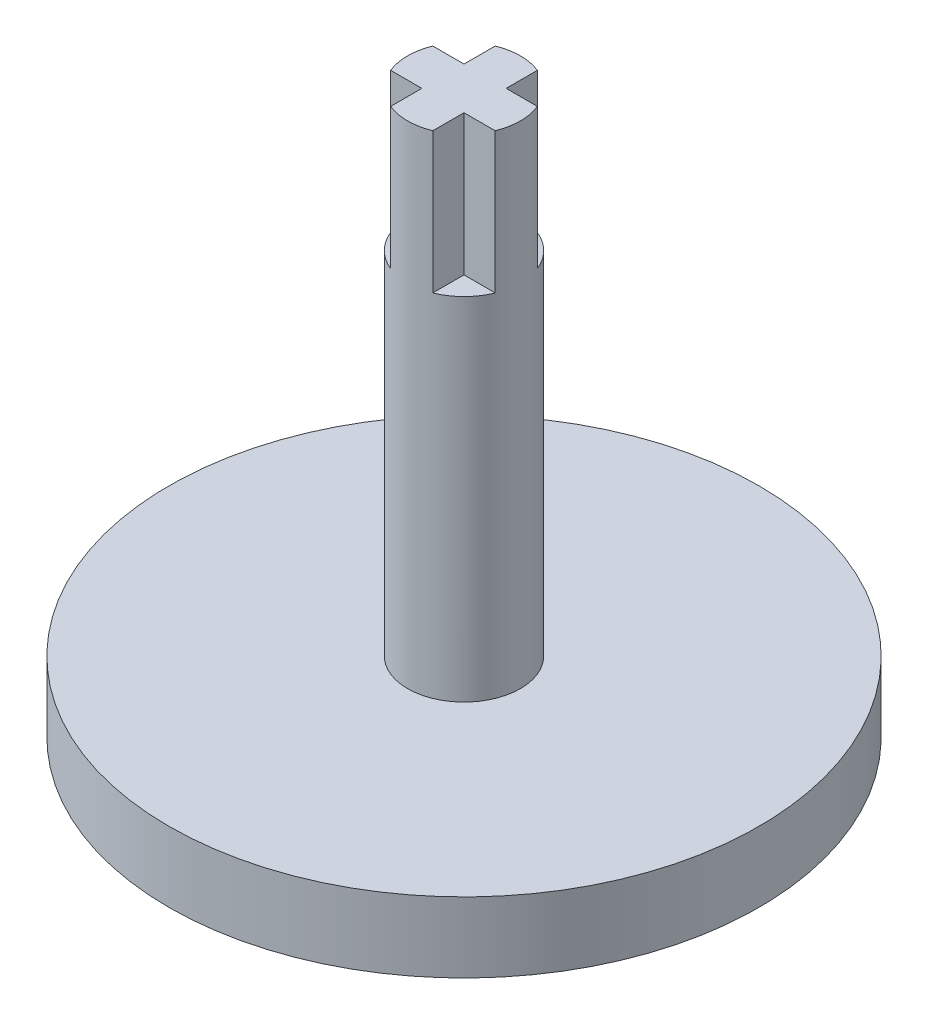
ISO-10303-21;
HEADER;
FILE_DESCRIPTION(('STEP AP214'),'2;1');
FILE_NAME('part.step','',(''),(''),'','','');
FILE_SCHEMA(('AUTOMOTIVE_DESIGN { 1 0 10303 214 1 1 1 1 }'));
ENDSEC;
DATA;
#1=APPLICATION_CONTEXT('core data for automotive mechanical design processes');
#2=APPLICATION_PROTOCOL_DEFINITION('international standard','automotive_design',2000,#1);
#3=PRODUCT_CONTEXT('',#1,'mechanical');
#4=PRODUCT('Part','Part','',(#3));
#5=PRODUCT_RELATED_PRODUCT_CATEGORY('part','',(#4));
#6=PRODUCT_DEFINITION_FORMATION('','',#4);
#7=PRODUCT_DEFINITION_CONTEXT('part definition',#1,'design');
#8=PRODUCT_DEFINITION('design','',#6,#7);
#9=PRODUCT_DEFINITION_SHAPE('','',#8);
#10=(LENGTH_UNIT() NAMED_UNIT(*) SI_UNIT(.MILLI.,.METRE.));
#11=(NAMED_UNIT(*) PLANE_ANGLE_UNIT() SI_UNIT($,.RADIAN.));
#12=(NAMED_UNIT(*) SI_UNIT($,.STERADIAN.) SOLID_ANGLE_UNIT());
#13=UNCERTAINTY_MEASURE_WITH_UNIT(LENGTH_MEASURE(1.E-05),#10,'distance_accuracy_value','');
#14=(GEOMETRIC_REPRESENTATION_CONTEXT(3) GLOBAL_UNCERTAINTY_ASSIGNED_CONTEXT((#13)) GLOBAL_UNIT_ASSIGNED_CONTEXT((#10,
#11,#12)) REPRESENTATION_CONTEXT('',''));
#15=CARTESIAN_POINT('',(0.,0.,0.));
#16=DIRECTION('',(0.,0.,1.));
#17=DIRECTION('',(1.,0.,0.));
#18=AXIS2_PLACEMENT_3D('',#15,#16,#17);
#19=CARTESIAN_POINT('',(0.,30.,0.));
#20=DIRECTION('',(0.,1.,0.));
#21=DIRECTION('',(0.,0.,1.));
#22=AXIS2_PLACEMENT_3D('',#19,#20,#21);
#23=PLANE('',#22);
#24=DIRECTION('',(0.,0.,-1.));
#25=VECTOR('',#24,1.);
#26=CARTESIAN_POINT('',(1.5,30.,0.));
#27=LINE('',#26,#25);
#28=CARTESIAN_POINT('',(1.50000000000002,30.,-1.5));
#29=VERTEX_POINT('',#28);
#30=CARTESIAN_POINT('',(1.50000000000003,30.,-3.72427509725046));
#31=VERTEX_POINT('',#30);
#32=EDGE_CURVE('E57',#29,#31,#27,.T.);
#33=ORIENTED_EDGE('',*,*,#32,.F.);
#34=DIRECTION('',(-1.,0.,0.));
#35=VECTOR('',#34,1.);
#36=CARTESIAN_POINT('',(0.,30.,-1.5));
#37=LINE('',#36,#35);
#38=CARTESIAN_POINT('',(3.72427509725048,30.,-1.49999999999999));
#39=VERTEX_POINT('',#38);
#40=EDGE_CURVE('E315',#39,#29,#37,.T.);
#41=ORIENTED_EDGE('',*,*,#40,.F.);
#42=CARTESIAN_POINT('',(0.,30.,0.));
#43=DIRECTION('',(0.,1.,0.));
#44=DIRECTION('',(0.,0.,1.));
#45=AXIS2_PLACEMENT_3D('',#42,#43,#44);
#46=CIRCLE('',#45,4.015);
#47=EDGE_CURVE('E211',#39,#31,#46,.T.);
#48=ORIENTED_EDGE('',*,*,#47,.T.);
#49=EDGE_LOOP('',(#33,#41,#48));
#50=FACE_BOUND('',#49,.T.);
#51=ADVANCED_FACE('F40',(#50),#23,.T.);
#52=DIRECTION('',(1.,0.,0.));
#53=VECTOR('',#52,1.);
#54=CARTESIAN_POINT('',(0.,30.,1.5));
#55=LINE('',#54,#53);
#56=CARTESIAN_POINT('',(1.49999999999999,30.,1.50000000000003));
#57=VERTEX_POINT('',#56);
#58=CARTESIAN_POINT('',(3.72427509725045,30.,1.50000000000004));
#59=VERTEX_POINT('',#58);
#60=EDGE_CURVE('E65',#57,#59,#55,.T.);
#61=ORIENTED_EDGE('',*,*,#60,.F.);
#62=DIRECTION('',(0.,0.,-1.));
#63=VECTOR('',#62,1.);
#64=CARTESIAN_POINT('',(1.5,30.,0.));
#65=LINE('',#64,#63);
#66=CARTESIAN_POINT('',(1.49999999999997,30.,3.72427509725048));
#67=VERTEX_POINT('',#66);
#68=EDGE_CURVE('E276',#67,#57,#65,.T.);
#69=ORIENTED_EDGE('',*,*,#68,.F.);
#70=EDGE_CURVE('E209',#67,#59,#46,.T.);
#71=ORIENTED_EDGE('',*,*,#70,.T.);
#72=EDGE_LOOP('',(#61,#69,#71));
#73=FACE_BOUND('',#72,.T.);
#74=ADVANCED_FACE('F241',(#73),#23,.T.);
#75=DIRECTION('',(0.,0.,1.));
#76=VECTOR('',#75,1.);
#77=CARTESIAN_POINT('',(-1.5,30.,0.));
#78=LINE('',#77,#76);
#79=CARTESIAN_POINT('',(-1.5,30.,1.49999999999997));
#80=VERTEX_POINT('',#79);
#81=CARTESIAN_POINT('',(-1.5,30.,3.72427509725047));
#82=VERTEX_POINT('',#81);
#83=EDGE_CURVE('E268',#80,#82,#78,.T.);
#84=ORIENTED_EDGE('',*,*,#83,.F.);
#85=DIRECTION('',(1.,0.,0.));
#86=VECTOR('',#85,1.);
#87=CARTESIAN_POINT('',(0.,30.,1.5));
#88=LINE('',#87,#86);
#89=CARTESIAN_POINT('',(-3.72427509725049,30.,1.49999999999996));
#90=VERTEX_POINT('',#89);
#91=EDGE_CURVE('E270',#90,#80,#88,.T.);
#92=ORIENTED_EDGE('',*,*,#91,.F.);
#93=EDGE_CURVE('E206',#90,#82,#46,.T.);
#94=ORIENTED_EDGE('',*,*,#93,.T.);
#95=EDGE_LOOP('',(#84,#92,#94));
#96=FACE_BOUND('',#95,.T.);
#97=ADVANCED_FACE('F247',(#96),#23,.T.);
#98=CARTESIAN_POINT('',(0.,5.,0.));
#99=DIRECTION('',(0.,-1.,0.));
#100=DIRECTION('',(0.,0.,-1.));
#101=AXIS2_PLACEMENT_3D('',#98,#99,#100);
#102=CYLINDRICAL_SURFACE('',#101,21.);
#103=CARTESIAN_POINT('',(0.,5.,0.));
#104=DIRECTION('',(0.,1.,0.));
#105=DIRECTION('',(0.,0.,1.));
#106=AXIS2_PLACEMENT_3D('',#103,#104,#105);
#107=CIRCLE('',#106,21.);
#108=CARTESIAN_POINT('',(0.,5.,21.));
#109=VERTEX_POINT('',#108);
#110=EDGE_CURVE('E49',#109,#109,#107,.T.);
#111=ORIENTED_EDGE('',*,*,#110,.F.);
#112=EDGE_LOOP('',(#111));
#113=FACE_BOUND('',#112,.T.);
#114=CARTESIAN_POINT('',(0.,0.,0.));
#115=DIRECTION('',(0.,1.,0.));
#116=DIRECTION('',(0.,0.,1.));
#117=AXIS2_PLACEMENT_3D('',#114,#115,#116);
#118=CIRCLE('',#117,21.);
#119=CARTESIAN_POINT('',(0.,0.,21.));
#120=VERTEX_POINT('',#119);
#121=EDGE_CURVE('E44',#120,#120,#118,.T.);
#122=ORIENTED_EDGE('',*,*,#121,.T.);
#123=EDGE_LOOP('',(#122));
#124=FACE_BOUND('',#123,.T.);
#125=ADVANCED_FACE('F42',(#113,#124),#102,.T.);
#126=CARTESIAN_POINT('',(0.,5.,0.));
#127=DIRECTION('',(0.,1.,0.));
#128=DIRECTION('',(0.,0.,1.));
#129=AXIS2_PLACEMENT_3D('',#126,#127,#128);
#130=PLANE('',#129);
#131=CARTESIAN_POINT('',(0.,5.,0.));
#132=DIRECTION('',(0.,1.,0.));
#133=DIRECTION('',(0.,0.,1.));
#134=AXIS2_PLACEMENT_3D('',#131,#132,#133);
#135=CIRCLE('',#134,4.015);
#136=CARTESIAN_POINT('',(0.,5.,4.015));
#137=VERTEX_POINT('',#136);
#138=EDGE_CURVE('E11',#137,#137,#135,.T.);
#139=ORIENTED_EDGE('',*,*,#138,.F.);
#140=EDGE_LOOP('',(#139));
#141=FACE_BOUND('',#140,.T.);
#142=ORIENTED_EDGE('',*,*,#110,.T.);
#143=EDGE_LOOP('',(#142));
#144=FACE_BOUND('',#143,.T.);
#145=ADVANCED_FACE('F227',(#141,#144),#130,.T.);
#146=CARTESIAN_POINT('',(0.,0.,0.));
#147=DIRECTION('',(0.,1.,0.));
#148=DIRECTION('',(0.,0.,1.));
#149=AXIS2_PLACEMENT_3D('',#146,#147,#148);
#150=PLANE('',#149);
#151=CARTESIAN_POINT('',(0.,0.,14.5));
#152=DIRECTION('',(0.,-1.,0.));
#153=DIRECTION('',(0.,0.,1.));
#154=AXIS2_PLACEMENT_3D('',#151,#152,#153);
#155=CIRCLE('',#154,5.15);
#156=CARTESIAN_POINT('',(0.,0.,19.65));
#157=VERTEX_POINT('',#156);
#158=EDGE_CURVE('E176',#157,#157,#155,.T.);
#159=ORIENTED_EDGE('',*,*,#158,.F.);
#160=EDGE_LOOP('',(#159));
#161=FACE_BOUND('',#160,.T.);
#162=CARTESIAN_POINT('',(-10.253048327205,0.,10.2530483272049));
#163=DIRECTION('',(0.,-1.,0.));
#164=DIRECTION('',(-0.707106781186554,0.,0.707106781186541));
#165=AXIS2_PLACEMENT_3D('',#162,#163,#164);
#166=CIRCLE('',#165,5.15);
#167=CARTESIAN_POINT('',(-13.8946482503158,0.,13.8946482503155));
#168=VERTEX_POINT('',#167);
#169=EDGE_CURVE('E170',#168,#168,#166,.T.);
#170=ORIENTED_EDGE('',*,*,#169,.F.);
#171=EDGE_LOOP('',(#170));
#172=FACE_BOUND('',#171,.T.);
#173=CARTESIAN_POINT('',(14.5,0.,0.));
#174=DIRECTION('',(0.,-1.,0.));
#175=DIRECTION('',(1.,0.,0.));
#176=AXIS2_PLACEMENT_3D('',#173,#174,#175);
#177=CIRCLE('',#176,5.15);
#178=CARTESIAN_POINT('',(19.65,0.,0.));
#179=VERTEX_POINT('',#178);
#180=EDGE_CURVE('E188',#179,#179,#177,.T.);
#181=ORIENTED_EDGE('',*,*,#180,.F.);
#182=EDGE_LOOP('',(#181));
#183=FACE_BOUND('',#182,.T.);
#184=CARTESIAN_POINT('',(10.2530483272049,0.,10.253048327205));
#185=DIRECTION('',(0.,-1.,0.));
#186=DIRECTION('',(0.707106781186544,0.,0.707106781186551));
#187=AXIS2_PLACEMENT_3D('',#184,#185,#186);
#188=CIRCLE('',#187,5.15);
#189=CARTESIAN_POINT('',(13.8946482503156,0.,13.8946482503157));
#190=VERTEX_POINT('',#189);
#191=EDGE_CURVE('E182',#190,#190,#188,.T.);
#192=ORIENTED_EDGE('',*,*,#191,.F.);
#193=EDGE_LOOP('',(#192));
#194=FACE_BOUND('',#193,.T.);
#195=CARTESIAN_POINT('',(-10.2530483272048,0.,-10.2530483272051));
#196=DIRECTION('',(0.,-1.,0.));
#197=DIRECTION('',(-0.707106781186539,0.,-0.707106781186556));
#198=AXIS2_PLACEMENT_3D('',#195,#196,#197);
#199=CIRCLE('',#198,5.15);
#200=CARTESIAN_POINT('',(-13.8946482503155,0.,-13.8946482503158));
#201=VERTEX_POINT('',#200);
#202=EDGE_CURVE('E155',#201,#201,#199,.T.);
#203=ORIENTED_EDGE('',*,*,#202,.F.);
#204=EDGE_LOOP('',(#203));
#205=FACE_BOUND('',#204,.T.);
#206=CARTESIAN_POINT('',(-14.5,0.,-1.51879438239676E-13));
#207=DIRECTION('',(0.,-1.,0.));
#208=DIRECTION('',(-1.,0.,0.));
#209=AXIS2_PLACEMENT_3D('',#206,#207,#208);
#210=CIRCLE('',#209,5.15);
#211=CARTESIAN_POINT('',(-19.65,0.,-2.05822824924803E-13));
#212=VERTEX_POINT('',#211);
#213=EDGE_CURVE('E165',#212,#212,#210,.T.);
#214=ORIENTED_EDGE('',*,*,#213,.F.);
#215=EDGE_LOOP('',(#214));
#216=FACE_BOUND('',#215,.T.);
#217=CARTESIAN_POINT('',(10.253048327205,0.,-10.2530483272049));
#218=DIRECTION('',(0.,-1.,0.));
#219=DIRECTION('',(0.707106781186549,0.,-0.707106781186546));
#220=AXIS2_PLACEMENT_3D('',#217,#218,#219);
#221=CIRCLE('',#220,5.15);
#222=CARTESIAN_POINT('',(13.8946482503157,0.,-13.8946482503156));
#223=VERTEX_POINT('',#222);
#224=EDGE_CURVE('E194',#223,#223,#221,.T.);
#225=ORIENTED_EDGE('',*,*,#224,.F.);
#226=EDGE_LOOP('',(#225));
#227=FACE_BOUND('',#226,.T.);
#228=CARTESIAN_POINT('',(0.,0.,-14.5));
#229=DIRECTION('',(0.,-1.,0.));
#230=DIRECTION('',(0.,0.,-1.));
#231=AXIS2_PLACEMENT_3D('',#228,#229,#230);
#232=CIRCLE('',#231,5.15);
#233=CARTESIAN_POINT('',(0.,0.,-19.65));
#234=VERTEX_POINT('',#233);
#235=EDGE_CURVE('E200',#234,#234,#232,.T.);
#236=ORIENTED_EDGE('',*,*,#235,.F.);
#237=EDGE_LOOP('',(#236));
#238=FACE_BOUND('',#237,.T.);
#239=CARTESIAN_POINT('',(0.,0.,0.));
#240=DIRECTION('',(0.,-1.,0.));
#241=DIRECTION('',(0.,0.,-1.));
#242=AXIS2_PLACEMENT_3D('',#239,#240,#241);
#243=CIRCLE('',#242,6.05);
#244=CARTESIAN_POINT('',(0.,0.,-6.05));
#245=VERTEX_POINT('',#244);
#246=EDGE_CURVE('E210',#245,#245,#243,.T.);
#247=ORIENTED_EDGE('',*,*,#246,.F.);
#248=EDGE_LOOP('',(#247));
#249=FACE_BOUND('',#248,.T.);
#250=ORIENTED_EDGE('',*,*,#121,.F.);
#251=EDGE_LOOP('',(#250));
#252=FACE_BOUND('',#251,.T.);
#253=ADVANCED_FACE('F224',(#161,#172,#183,#194,#205,#216,#227,#238,#249,#252),#150,.F.);
#254=CARTESIAN_POINT('',(0.,3.5,0.));
#255=DIRECTION('',(0.,-1.,0.));
#256=DIRECTION('',(0.,0.,-1.));
#257=AXIS2_PLACEMENT_3D('',#254,#255,#256);
#258=CYLINDRICAL_SURFACE('',#257,6.05);
#259=CARTESIAN_POINT('',(0.,3.5,0.));
#260=DIRECTION('',(0.,-1.,0.));
#261=DIRECTION('',(0.,0.,-1.));
#262=AXIS2_PLACEMENT_3D('',#259,#260,#261);
#263=CIRCLE('',#262,6.05);
#264=CARTESIAN_POINT('',(0.,3.5,-6.05));
#265=VERTEX_POINT('',#264);
#266=EDGE_CURVE('E213',#265,#265,#263,.T.);
#267=ORIENTED_EDGE('',*,*,#266,.F.);
#268=EDGE_LOOP('',(#267));
#269=FACE_BOUND('',#268,.T.);
#270=ORIENTED_EDGE('',*,*,#246,.T.);
#271=EDGE_LOOP('',(#270));
#272=FACE_BOUND('',#271,.T.);
#273=ADVANCED_FACE('F226',(#269,#272),#258,.F.);
#274=CARTESIAN_POINT('',(0.,3.5,0.));
#275=DIRECTION('',(0.,-1.,0.));
#276=DIRECTION('',(0.,0.,-1.));
#277=AXIS2_PLACEMENT_3D('',#274,#275,#276);
#278=PLANE('',#277);
#279=ORIENTED_EDGE('',*,*,#266,.T.);
#280=EDGE_LOOP('',(#279));
#281=FACE_BOUND('',#280,.T.);
#282=ADVANCED_FACE('F233',(#281),#278,.T.);
#283=CARTESIAN_POINT('',(0.,30.,0.));
#284=DIRECTION('',(0.,-1.,0.));
#285=DIRECTION('',(0.,0.,-1.));
#286=AXIS2_PLACEMENT_3D('',#283,#284,#285);
#287=CYLINDRICAL_SURFACE('',#286,4.015);
#288=ORIENTED_EDGE('',*,*,#70,.F.);
#289=DIRECTION('',(0.,-1.,0.));
#290=VECTOR('',#289,1.);
#291=CARTESIAN_POINT('',(1.49999999999997,40.,3.72427509725048));
#292=LINE('',#291,#290);
#293=CARTESIAN_POINT('',(1.49999999999997,40.,3.72427509725048));
#294=VERTEX_POINT('',#293);
#295=EDGE_CURVE('E292',#294,#67,#292,.T.);
#296=ORIENTED_EDGE('',*,*,#295,.F.);
#297=CARTESIAN_POINT('',(0.,40.,0.));
#298=DIRECTION('',(0.,1.,0.));
#299=DIRECTION('',(0.,0.,1.));
#300=AXIS2_PLACEMENT_3D('',#297,#298,#299);
#301=CIRCLE('',#300,4.015);
#302=CARTESIAN_POINT('',(-1.5,40.,3.72427509725047));
#303=VERTEX_POINT('',#302);
#304=EDGE_CURVE('E332',#303,#294,#301,.T.);
#305=ORIENTED_EDGE('',*,*,#304,.F.);
#306=DIRECTION('',(0.,-1.,0.));
#307=VECTOR('',#306,1.);
#308=CARTESIAN_POINT('',(-1.5,40.,3.72427509725047));
#309=LINE('',#308,#307);
#310=EDGE_CURVE('E290',#303,#82,#309,.T.);
#311=ORIENTED_EDGE('',*,*,#310,.T.);
#312=ORIENTED_EDGE('',*,*,#93,.F.);
#313=DIRECTION('',(0.,-1.,0.));
#314=VECTOR('',#313,1.);
#315=CARTESIAN_POINT('',(-3.72427509725049,40.,1.49999999999996));
#316=LINE('',#315,#314);
#317=CARTESIAN_POINT('',(-3.72427509725049,40.,1.49999999999996));
#318=VERTEX_POINT('',#317);
#319=EDGE_CURVE('E160',#318,#90,#316,.T.);
#320=ORIENTED_EDGE('',*,*,#319,.F.);
#321=CARTESIAN_POINT('',(0.,40.,0.));
#322=DIRECTION('',(0.,1.,0.));
#323=DIRECTION('',(0.,0.,1.));
#324=AXIS2_PLACEMENT_3D('',#321,#322,#323);
#325=CIRCLE('',#324,4.015);
#326=CARTESIAN_POINT('',(-3.72427509725046,40.,-1.50000000000001));
#327=VERTEX_POINT('',#326);
#328=EDGE_CURVE('E142',#327,#318,#325,.T.);
#329=ORIENTED_EDGE('',*,*,#328,.F.);
#330=DIRECTION('',(0.,-1.,0.));
#331=VECTOR('',#330,1.);
#332=CARTESIAN_POINT('',(-3.72427509725046,40.,-1.50000000000001));
#333=LINE('',#332,#331);
#334=CARTESIAN_POINT('',(-3.72427509725046,30.,-1.50000000000001));
#335=VERTEX_POINT('',#334);
#336=EDGE_CURVE('E139',#327,#335,#333,.T.);
#337=ORIENTED_EDGE('',*,*,#336,.T.);
#338=CARTESIAN_POINT('',(-1.5,30.,-3.72427509725047));
#339=VERTEX_POINT('',#338);
#340=EDGE_CURVE('E340',#339,#335,#46,.T.);
#341=ORIENTED_EDGE('',*,*,#340,.F.);
#342=DIRECTION('',(0.,-1.,0.));
#343=VECTOR('',#342,1.);
#344=CARTESIAN_POINT('',(-1.5,40.,-3.72427509725047));
#345=LINE('',#344,#343);
#346=CARTESIAN_POINT('',(-1.5,40.,-3.72427509725047));
#347=VERTEX_POINT('',#346);
#348=EDGE_CURVE('E312',#347,#339,#345,.T.);
#349=ORIENTED_EDGE('',*,*,#348,.F.);
#350=CARTESIAN_POINT('',(0.,40.,0.));
#351=DIRECTION('',(0.,1.,0.));
#352=DIRECTION('',(0.,0.,1.));
#353=AXIS2_PLACEMENT_3D('',#350,#351,#352);
#354=CIRCLE('',#353,4.015);
#355=CARTESIAN_POINT('',(1.50000000000003,40.,-3.72427509725046));
#356=VERTEX_POINT('',#355);
#357=EDGE_CURVE('E148',#356,#347,#354,.T.);
#358=ORIENTED_EDGE('',*,*,#357,.F.);
#359=DIRECTION('',(0.,-1.,0.));
#360=VECTOR('',#359,1.);
#361=CARTESIAN_POINT('',(1.50000000000003,40.,-3.72427509725046));
#362=LINE('',#361,#360);
#363=EDGE_CURVE('E309',#356,#31,#362,.T.);
#364=ORIENTED_EDGE('',*,*,#363,.T.);
#365=ORIENTED_EDGE('',*,*,#47,.F.);
#366=DIRECTION('',(0.,-1.,0.));
#367=VECTOR('',#366,1.);
#368=CARTESIAN_POINT('',(3.72427509725048,40.,-1.49999999999999));
#369=LINE('',#368,#367);
#370=CARTESIAN_POINT('',(3.72427509725048,40.,-1.49999999999999));
#371=VERTEX_POINT('',#370);
#372=EDGE_CURVE('E303',#371,#39,#369,.T.);
#373=ORIENTED_EDGE('',*,*,#372,.F.);
#374=CARTESIAN_POINT('',(0.,40.,0.));
#375=DIRECTION('',(0.,1.,0.));
#376=DIRECTION('',(0.,0.,1.));
#377=AXIS2_PLACEMENT_3D('',#374,#375,#376);
#378=CIRCLE('',#377,4.015);
#379=CARTESIAN_POINT('',(3.72427509725045,40.,1.50000000000004));
#380=VERTEX_POINT('',#379);
#381=EDGE_CURVE('E326',#380,#371,#378,.T.);
#382=ORIENTED_EDGE('',*,*,#381,.F.);
#383=DIRECTION('',(0.,-1.,0.));
#384=VECTOR('',#383,1.);
#385=CARTESIAN_POINT('',(3.72427509725045,40.,1.50000000000004));
#386=LINE('',#385,#384);
#387=EDGE_CURVE('E300',#380,#59,#386,.T.);
#388=ORIENTED_EDGE('',*,*,#387,.T.);
#389=EDGE_LOOP('',(#288,#296,#305,#311,#312,#320,#329,#337,#341,#349,#358,#364,#365,#373,#382,#388));
#390=FACE_BOUND('',#389,.T.);
#391=ORIENTED_EDGE('',*,*,#138,.T.);
#392=EDGE_LOOP('',(#391));
#393=FACE_BOUND('',#392,.T.);
#394=ADVANCED_FACE('F252',(#390,#393),#287,.T.);
#395=DIRECTION('',(0.,0.,1.));
#396=VECTOR('',#395,1.);
#397=CARTESIAN_POINT('',(-1.5,30.,0.));
#398=LINE('',#397,#396);
#399=CARTESIAN_POINT('',(-1.5,30.,-1.50000000000001));
#400=VERTEX_POINT('',#399);
#401=EDGE_CURVE('E154',#339,#400,#398,.T.);
#402=ORIENTED_EDGE('',*,*,#401,.F.);
#403=ORIENTED_EDGE('',*,*,#340,.T.);
#404=DIRECTION('',(-1.,0.,0.));
#405=VECTOR('',#404,1.);
#406=CARTESIAN_POINT('',(0.,30.,-1.5));
#407=LINE('',#406,#405);
#408=EDGE_CURVE('E286',#400,#335,#407,.T.);
#409=ORIENTED_EDGE('',*,*,#408,.F.);
#410=EDGE_LOOP('',(#402,#403,#409));
#411=FACE_BOUND('',#410,.T.);
#412=ADVANCED_FACE('F243',(#411),#23,.T.);
#413=CARTESIAN_POINT('',(0.,3.,-14.5));
#414=DIRECTION('',(0.,-1.,0.));
#415=DIRECTION('',(0.,0.,-1.));
#416=AXIS2_PLACEMENT_3D('',#413,#414,#415);
#417=CYLINDRICAL_SURFACE('',#416,5.15);
#418=CARTESIAN_POINT('',(0.,3.,-14.5));
#419=DIRECTION('',(0.,-1.,0.));
#420=DIRECTION('',(0.,0.,-1.));
#421=AXIS2_PLACEMENT_3D('',#418,#419,#420);
#422=CIRCLE('',#421,5.15);
#423=CARTESIAN_POINT('',(0.,3.,-19.65));
#424=VERTEX_POINT('',#423);
#425=EDGE_CURVE('E203',#424,#424,#422,.T.);
#426=ORIENTED_EDGE('',*,*,#425,.F.);
#427=EDGE_LOOP('',(#426));
#428=FACE_BOUND('',#427,.T.);
#429=ORIENTED_EDGE('',*,*,#235,.T.);
#430=EDGE_LOOP('',(#429));
#431=FACE_BOUND('',#430,.T.);
#432=ADVANCED_FACE('F251',(#428,#431),#417,.F.);
#433=CARTESIAN_POINT('',(0.,3.,-14.5));
#434=DIRECTION('',(0.,-1.,0.));
#435=DIRECTION('',(0.,0.,-1.));
#436=AXIS2_PLACEMENT_3D('',#433,#434,#435);
#437=PLANE('',#436);
#438=ORIENTED_EDGE('',*,*,#425,.T.);
#439=EDGE_LOOP('',(#438));
#440=FACE_BOUND('',#439,.T.);
#441=ADVANCED_FACE('F258',(#440),#437,.T.);
#442=CARTESIAN_POINT('',(10.253048327205,3.,-10.2530483272049));
#443=DIRECTION('',(0.,-1.,0.));
#444=DIRECTION('',(0.,0.,-1.));
#445=AXIS2_PLACEMENT_3D('',#442,#443,#444);
#446=CYLINDRICAL_SURFACE('',#445,5.15);
#447=CARTESIAN_POINT('',(10.253048327205,3.,-10.2530483272049));
#448=DIRECTION('',(0.,-1.,0.));
#449=DIRECTION('',(0.707106781186549,0.,-0.707106781186546));
#450=AXIS2_PLACEMENT_3D('',#447,#448,#449);
#451=CIRCLE('',#450,5.15);
#452=CARTESIAN_POINT('',(13.8946482503157,3.,-13.8946482503156));
#453=VERTEX_POINT('',#452);
#454=EDGE_CURVE('E197',#453,#453,#451,.T.);
#455=ORIENTED_EDGE('',*,*,#454,.F.);
#456=EDGE_LOOP('',(#455));
#457=FACE_BOUND('',#456,.T.);
#458=ORIENTED_EDGE('',*,*,#224,.T.);
#459=EDGE_LOOP('',(#458));
#460=FACE_BOUND('',#459,.T.);
#461=ADVANCED_FACE('F429',(#457,#460),#446,.F.);
#462=CARTESIAN_POINT('',(10.253048327205,3.,-10.2530483272049));
#463=DIRECTION('',(0.,-1.,0.));
#464=DIRECTION('',(0.707106781186549,0.,-0.707106781186546));
#465=AXIS2_PLACEMENT_3D('',#462,#463,#464);
#466=PLANE('',#465);
#467=ORIENTED_EDGE('',*,*,#454,.T.);
#468=EDGE_LOOP('',(#467));
#469=FACE_BOUND('',#468,.T.);
#470=ADVANCED_FACE('F395',(#469),#466,.T.);
#471=CARTESIAN_POINT('',(-14.5,3.,-1.51879438239676E-13));
#472=DIRECTION('',(0.,-1.,0.));
#473=DIRECTION('',(0.,0.,-1.));
#474=AXIS2_PLACEMENT_3D('',#471,#472,#473);
#475=CYLINDRICAL_SURFACE('',#474,5.15);
#476=CARTESIAN_POINT('',(-14.5,3.,-1.51879438239676E-13));
#477=DIRECTION('',(0.,-1.,0.));
#478=DIRECTION('',(-1.,0.,0.));
#479=AXIS2_PLACEMENT_3D('',#476,#477,#478);
#480=CIRCLE('',#479,5.15);
#481=CARTESIAN_POINT('',(-19.65,3.,-2.05822824924803E-13));
#482=VERTEX_POINT('',#481);
#483=EDGE_CURVE('E167',#482,#482,#480,.T.);
#484=ORIENTED_EDGE('',*,*,#483,.F.);
#485=EDGE_LOOP('',(#484));
#486=FACE_BOUND('',#485,.T.);
#487=ORIENTED_EDGE('',*,*,#213,.T.);
#488=EDGE_LOOP('',(#487));
#489=FACE_BOUND('',#488,.T.);
#490=ADVANCED_FACE('F391',(#486,#489),#475,.F.);
#491=CARTESIAN_POINT('',(-14.5,3.,-1.51879438239676E-13));
#492=DIRECTION('',(0.,-1.,0.));
#493=DIRECTION('',(-1.,0.,0.));
#494=AXIS2_PLACEMENT_3D('',#491,#492,#493);
#495=PLANE('',#494);
#496=ORIENTED_EDGE('',*,*,#483,.T.);
#497=EDGE_LOOP('',(#496));
#498=FACE_BOUND('',#497,.T.);
#499=ADVANCED_FACE('F387',(#498),#495,.T.);
#500=CARTESIAN_POINT('',(-10.2530483272048,3.,-10.2530483272051));
#501=DIRECTION('',(0.,-1.,0.));
#502=DIRECTION('',(0.,0.,-1.));
#503=AXIS2_PLACEMENT_3D('',#500,#501,#502);
#504=CYLINDRICAL_SURFACE('',#503,5.15);
#505=CARTESIAN_POINT('',(-10.2530483272048,3.,-10.2530483272051));
#506=DIRECTION('',(0.,-1.,0.));
#507=DIRECTION('',(-0.707106781186539,0.,-0.707106781186556));
#508=AXIS2_PLACEMENT_3D('',#505,#506,#507);
#509=CIRCLE('',#508,5.15);
#510=CARTESIAN_POINT('',(-13.8946482503155,3.,-13.8946482503158));
#511=VERTEX_POINT('',#510);
#512=EDGE_CURVE('E158',#511,#511,#509,.T.);
#513=ORIENTED_EDGE('',*,*,#512,.F.);
#514=EDGE_LOOP('',(#513));
#515=FACE_BOUND('',#514,.T.);
#516=ORIENTED_EDGE('',*,*,#202,.T.);
#517=EDGE_LOOP('',(#516));
#518=FACE_BOUND('',#517,.T.);
#519=ADVANCED_FACE('F383',(#515,#518),#504,.F.);
#520=CARTESIAN_POINT('',(-10.2530483272048,3.,-10.2530483272051));
#521=DIRECTION('',(0.,-1.,0.));
#522=DIRECTION('',(-0.707106781186539,0.,-0.707106781186556));
#523=AXIS2_PLACEMENT_3D('',#520,#521,#522);
#524=PLANE('',#523);
#525=ORIENTED_EDGE('',*,*,#512,.T.);
#526=EDGE_LOOP('',(#525));
#527=FACE_BOUND('',#526,.T.);
#528=ADVANCED_FACE('F379',(#527),#524,.T.);
#529=CARTESIAN_POINT('',(10.2530483272049,3.,10.253048327205));
#530=DIRECTION('',(0.,-1.,0.));
#531=DIRECTION('',(0.,0.,-1.));
#532=AXIS2_PLACEMENT_3D('',#529,#530,#531);
#533=CYLINDRICAL_SURFACE('',#532,5.15);
#534=CARTESIAN_POINT('',(10.2530483272049,3.,10.253048327205));
#535=DIRECTION('',(0.,-1.,0.));
#536=DIRECTION('',(0.707106781186544,0.,0.707106781186551));
#537=AXIS2_PLACEMENT_3D('',#534,#535,#536);
#538=CIRCLE('',#537,5.15);
#539=CARTESIAN_POINT('',(13.8946482503156,3.,13.8946482503157));
#540=VERTEX_POINT('',#539);
#541=EDGE_CURVE('E185',#540,#540,#538,.T.);
#542=ORIENTED_EDGE('',*,*,#541,.F.);
#543=EDGE_LOOP('',(#542));
#544=FACE_BOUND('',#543,.T.);
#545=ORIENTED_EDGE('',*,*,#191,.T.);
#546=EDGE_LOOP('',(#545));
#547=FACE_BOUND('',#546,.T.);
#548=ADVANCED_FACE('F382',(#544,#547),#533,.F.);
#549=CARTESIAN_POINT('',(10.2530483272049,3.,10.253048327205));
#550=DIRECTION('',(0.,-1.,0.));
#551=DIRECTION('',(0.707106781186544,0.,0.707106781186551));
#552=AXIS2_PLACEMENT_3D('',#549,#550,#551);
#553=PLANE('',#552);
#554=ORIENTED_EDGE('',*,*,#541,.T.);
#555=EDGE_LOOP('',(#554));
#556=FACE_BOUND('',#555,.T.);
#557=ADVANCED_FACE('F413',(#556),#553,.T.);
#558=CARTESIAN_POINT('',(14.5,3.,0.));
#559=DIRECTION('',(0.,-1.,0.));
#560=DIRECTION('',(0.,0.,-1.));
#561=AXIS2_PLACEMENT_3D('',#558,#559,#560);
#562=CYLINDRICAL_SURFACE('',#561,5.15);
#563=CARTESIAN_POINT('',(14.5,3.,0.));
#564=DIRECTION('',(0.,-1.,0.));
#565=DIRECTION('',(1.,0.,0.));
#566=AXIS2_PLACEMENT_3D('',#563,#564,#565);
#567=CIRCLE('',#566,5.15);
#568=CARTESIAN_POINT('',(19.65,3.,0.));
#569=VERTEX_POINT('',#568);
#570=EDGE_CURVE('E191',#569,#569,#567,.T.);
#571=ORIENTED_EDGE('',*,*,#570,.F.);
#572=EDGE_LOOP('',(#571));
#573=FACE_BOUND('',#572,.T.);
#574=ORIENTED_EDGE('',*,*,#180,.T.);
#575=EDGE_LOOP('',(#574));
#576=FACE_BOUND('',#575,.T.);
#577=ADVANCED_FACE('F416',(#573,#576),#562,.F.);
#578=CARTESIAN_POINT('',(14.5,3.,0.));
#579=DIRECTION('',(0.,-1.,0.));
#580=DIRECTION('',(1.,0.,0.));
#581=AXIS2_PLACEMENT_3D('',#578,#579,#580);
#582=PLANE('',#581);
#583=ORIENTED_EDGE('',*,*,#570,.T.);
#584=EDGE_LOOP('',(#583));
#585=FACE_BOUND('',#584,.T.);
#586=ADVANCED_FACE('F405',(#585),#582,.T.);
#587=CARTESIAN_POINT('',(-10.253048327205,3.,10.2530483272049));
#588=DIRECTION('',(0.,-1.,0.));
#589=DIRECTION('',(0.,0.,-1.));
#590=AXIS2_PLACEMENT_3D('',#587,#588,#589);
#591=CYLINDRICAL_SURFACE('',#590,5.15);
#592=CARTESIAN_POINT('',(-10.253048327205,3.,10.2530483272049));
#593=DIRECTION('',(0.,-1.,0.));
#594=DIRECTION('',(-0.707106781186554,0.,0.707106781186541));
#595=AXIS2_PLACEMENT_3D('',#592,#593,#594);
#596=CIRCLE('',#595,5.15);
#597=CARTESIAN_POINT('',(-13.8946482503158,3.,13.8946482503155));
#598=VERTEX_POINT('',#597);
#599=EDGE_CURVE('E173',#598,#598,#596,.T.);
#600=ORIENTED_EDGE('',*,*,#599,.F.);
#601=EDGE_LOOP('',(#600));
#602=FACE_BOUND('',#601,.T.);
#603=ORIENTED_EDGE('',*,*,#169,.T.);
#604=EDGE_LOOP('',(#603));
#605=FACE_BOUND('',#604,.T.);
#606=ADVANCED_FACE('F401',(#602,#605),#591,.F.);
#607=CARTESIAN_POINT('',(-10.253048327205,3.,10.2530483272049));
#608=DIRECTION('',(0.,-1.,0.));
#609=DIRECTION('',(-0.707106781186554,0.,0.707106781186541));
#610=AXIS2_PLACEMENT_3D('',#607,#608,#609);
#611=PLANE('',#610);
#612=ORIENTED_EDGE('',*,*,#599,.T.);
#613=EDGE_LOOP('',(#612));
#614=FACE_BOUND('',#613,.T.);
#615=ADVANCED_FACE('F397',(#614),#611,.T.);
#616=CARTESIAN_POINT('',(0.,3.,14.5));
#617=DIRECTION('',(0.,-1.,0.));
#618=DIRECTION('',(0.,0.,-1.));
#619=AXIS2_PLACEMENT_3D('',#616,#617,#618);
#620=CYLINDRICAL_SURFACE('',#619,5.15);
#621=CARTESIAN_POINT('',(0.,3.,14.5));
#622=DIRECTION('',(0.,-1.,0.));
#623=DIRECTION('',(0.,0.,1.));
#624=AXIS2_PLACEMENT_3D('',#621,#622,#623);
#625=CIRCLE('',#624,5.15);
#626=CARTESIAN_POINT('',(0.,3.,19.65));
#627=VERTEX_POINT('',#626);
#628=EDGE_CURVE('E179',#627,#627,#625,.T.);
#629=ORIENTED_EDGE('',*,*,#628,.F.);
#630=EDGE_LOOP('',(#629));
#631=FACE_BOUND('',#630,.T.);
#632=ORIENTED_EDGE('',*,*,#158,.T.);
#633=EDGE_LOOP('',(#632));
#634=FACE_BOUND('',#633,.T.);
#635=ADVANCED_FACE('F400',(#631,#634),#620,.F.);
#636=CARTESIAN_POINT('',(0.,3.,14.5));
#637=DIRECTION('',(0.,-1.,0.));
#638=DIRECTION('',(0.,0.,1.));
#639=AXIS2_PLACEMENT_3D('',#636,#637,#638);
#640=PLANE('',#639);
#641=ORIENTED_EDGE('',*,*,#628,.T.);
#642=EDGE_LOOP('',(#641));
#643=FACE_BOUND('',#642,.T.);
#644=ADVANCED_FACE('F378',(#643),#640,.T.);
#645=CARTESIAN_POINT('',(-1.5,40.,0.));
#646=DIRECTION('',(1.,0.,0.));
#647=DIRECTION('',(0.,0.,-1.));
#648=AXIS2_PLACEMENT_3D('',#645,#646,#647);
#649=PLANE('',#648);
#650=ORIENTED_EDGE('',*,*,#401,.T.);
#651=DIRECTION('',(0.,-1.,0.));
#652=VECTOR('',#651,1.);
#653=CARTESIAN_POINT('',(-1.5,40.,-1.50000000000001));
#654=LINE('',#653,#652);
#655=CARTESIAN_POINT('',(-1.5,40.,-1.50000000000001));
#656=VERTEX_POINT('',#655);
#657=EDGE_CURVE('E136',#656,#400,#654,.T.);
#658=ORIENTED_EDGE('',*,*,#657,.F.);
#659=DIRECTION('',(0.,0.,1.));
#660=VECTOR('',#659,1.);
#661=CARTESIAN_POINT('',(-1.5,40.,0.));
#662=LINE('',#661,#660);
#663=EDGE_CURVE('E143',#347,#656,#662,.T.);
#664=ORIENTED_EDGE('',*,*,#663,.F.);
#665=ORIENTED_EDGE('',*,*,#348,.T.);
#666=EDGE_LOOP('',(#650,#658,#664,#665));
#667=FACE_BOUND('',#666,.T.);
#668=ADVANCED_FACE('F153',(#667),#649,.F.);
#669=CARTESIAN_POINT('',(0.,40.,-1.5));
#670=DIRECTION('',(0.,0.,1.));
#671=DIRECTION('',(1.,0.,0.));
#672=AXIS2_PLACEMENT_3D('',#669,#670,#671);
#673=PLANE('',#672);
#674=ORIENTED_EDGE('',*,*,#408,.T.);
#675=ORIENTED_EDGE('',*,*,#336,.F.);
#676=DIRECTION('',(-1.,0.,0.));
#677=VECTOR('',#676,1.);
#678=CARTESIAN_POINT('',(0.,40.,-1.5));
#679=LINE('',#678,#677);
#680=EDGE_CURVE('E131',#656,#327,#679,.T.);
#681=ORIENTED_EDGE('',*,*,#680,.F.);
#682=ORIENTED_EDGE('',*,*,#657,.T.);
#683=EDGE_LOOP('',(#674,#675,#681,#682));
#684=FACE_BOUND('',#683,.T.);
#685=ADVANCED_FACE('F134',(#684),#673,.F.);
#686=CARTESIAN_POINT('',(0.,40.,1.5));
#687=DIRECTION('',(0.,0.,-1.));
#688=DIRECTION('',(-1.,0.,0.));
#689=AXIS2_PLACEMENT_3D('',#686,#687,#688);
#690=PLANE('',#689);
#691=ORIENTED_EDGE('',*,*,#91,.T.);
#692=DIRECTION('',(0.,-1.,0.));
#693=VECTOR('',#692,1.);
#694=CARTESIAN_POINT('',(-1.5,40.,1.49999999999997));
#695=LINE('',#694,#693);
#696=CARTESIAN_POINT('',(-1.5,40.,1.49999999999997));
#697=VERTEX_POINT('',#696);
#698=EDGE_CURVE('E283',#697,#80,#695,.T.);
#699=ORIENTED_EDGE('',*,*,#698,.F.);
#700=DIRECTION('',(1.,0.,0.));
#701=VECTOR('',#700,1.);
#702=CARTESIAN_POINT('',(0.,40.,1.5));
#703=LINE('',#702,#701);
#704=EDGE_CURVE('E335',#318,#697,#703,.T.);
#705=ORIENTED_EDGE('',*,*,#704,.F.);
#706=ORIENTED_EDGE('',*,*,#319,.T.);
#707=EDGE_LOOP('',(#691,#699,#705,#706));
#708=FACE_BOUND('',#707,.T.);
#709=ADVANCED_FACE('F281',(#708),#690,.F.);
#710=CARTESIAN_POINT('',(-1.5,40.,0.));
#711=DIRECTION('',(1.,0.,0.));
#712=DIRECTION('',(0.,0.,-1.));
#713=AXIS2_PLACEMENT_3D('',#710,#711,#712);
#714=PLANE('',#713);
#715=ORIENTED_EDGE('',*,*,#83,.T.);
#716=ORIENTED_EDGE('',*,*,#310,.F.);
#717=DIRECTION('',(0.,0.,1.));
#718=VECTOR('',#717,1.);
#719=CARTESIAN_POINT('',(-1.5,40.,0.));
#720=LINE('',#719,#718);
#721=EDGE_CURVE('E289',#697,#303,#720,.T.);
#722=ORIENTED_EDGE('',*,*,#721,.F.);
#723=ORIENTED_EDGE('',*,*,#698,.T.);
#724=EDGE_LOOP('',(#715,#716,#722,#723));
#725=FACE_BOUND('',#724,.T.);
#726=ADVANCED_FACE('F288',(#725),#714,.F.);
#727=CARTESIAN_POINT('',(1.5,40.,0.));
#728=DIRECTION('',(-1.,0.,0.));
#729=DIRECTION('',(0.,0.,1.));
#730=AXIS2_PLACEMENT_3D('',#727,#728,#729);
#731=PLANE('',#730);
#732=ORIENTED_EDGE('',*,*,#68,.T.);
#733=DIRECTION('',(0.,-1.,0.));
#734=VECTOR('',#733,1.);
#735=CARTESIAN_POINT('',(1.49999999999999,40.,1.50000000000003));
#736=LINE('',#735,#734);
#737=CARTESIAN_POINT('',(1.49999999999999,40.,1.50000000000003));
#738=VERTEX_POINT('',#737);
#739=EDGE_CURVE('E297',#738,#57,#736,.T.);
#740=ORIENTED_EDGE('',*,*,#739,.F.);
#741=DIRECTION('',(0.,0.,-1.));
#742=VECTOR('',#741,1.);
#743=CARTESIAN_POINT('',(1.5,40.,0.));
#744=LINE('',#743,#742);
#745=EDGE_CURVE('E330',#294,#738,#744,.T.);
#746=ORIENTED_EDGE('',*,*,#745,.F.);
#747=ORIENTED_EDGE('',*,*,#295,.T.);
#748=EDGE_LOOP('',(#732,#740,#746,#747));
#749=FACE_BOUND('',#748,.T.);
#750=ADVANCED_FACE('F360',(#749),#731,.F.);
#751=CARTESIAN_POINT('',(0.,40.,1.5));
#752=DIRECTION('',(0.,0.,-1.));
#753=DIRECTION('',(-1.,0.,0.));
#754=AXIS2_PLACEMENT_3D('',#751,#752,#753);
#755=PLANE('',#754);
#756=ORIENTED_EDGE('',*,*,#60,.T.);
#757=ORIENTED_EDGE('',*,*,#387,.F.);
#758=DIRECTION('',(1.,0.,0.));
#759=VECTOR('',#758,1.);
#760=CARTESIAN_POINT('',(0.,40.,1.5));
#761=LINE('',#760,#759);
#762=EDGE_CURVE('E328',#738,#380,#761,.T.);
#763=ORIENTED_EDGE('',*,*,#762,.F.);
#764=ORIENTED_EDGE('',*,*,#739,.T.);
#765=EDGE_LOOP('',(#756,#757,#763,#764));
#766=FACE_BOUND('',#765,.T.);
#767=ADVANCED_FACE('F358',(#766),#755,.F.);
#768=CARTESIAN_POINT('',(0.,40.,-1.5));
#769=DIRECTION('',(0.,0.,1.));
#770=DIRECTION('',(1.,0.,0.));
#771=AXIS2_PLACEMENT_3D('',#768,#769,#770);
#772=PLANE('',#771);
#773=ORIENTED_EDGE('',*,*,#40,.T.);
#774=DIRECTION('',(0.,-1.,0.));
#775=VECTOR('',#774,1.);
#776=CARTESIAN_POINT('',(1.50000000000002,40.,-1.5));
#777=LINE('',#776,#775);
#778=CARTESIAN_POINT('',(1.50000000000002,40.,-1.5));
#779=VERTEX_POINT('',#778);
#780=EDGE_CURVE('E306',#779,#29,#777,.T.);
#781=ORIENTED_EDGE('',*,*,#780,.F.);
#782=DIRECTION('',(-1.,0.,0.));
#783=VECTOR('',#782,1.);
#784=CARTESIAN_POINT('',(0.,40.,-1.5));
#785=LINE('',#784,#783);
#786=EDGE_CURVE('E324',#371,#779,#785,.T.);
#787=ORIENTED_EDGE('',*,*,#786,.F.);
#788=ORIENTED_EDGE('',*,*,#372,.T.);
#789=EDGE_LOOP('',(#773,#781,#787,#788));
#790=FACE_BOUND('',#789,.T.);
#791=ADVANCED_FACE('F351',(#790),#772,.F.);
#792=CARTESIAN_POINT('',(1.5,40.,0.));
#793=DIRECTION('',(-1.,0.,0.));
#794=DIRECTION('',(0.,0.,1.));
#795=AXIS2_PLACEMENT_3D('',#792,#793,#794);
#796=PLANE('',#795);
#797=ORIENTED_EDGE('',*,*,#32,.T.);
#798=ORIENTED_EDGE('',*,*,#363,.F.);
#799=DIRECTION('',(0.,0.,-1.));
#800=VECTOR('',#799,1.);
#801=CARTESIAN_POINT('',(1.5,40.,0.));
#802=LINE('',#801,#800);
#803=EDGE_CURVE('E322',#779,#356,#802,.T.);
#804=ORIENTED_EDGE('',*,*,#803,.F.);
#805=ORIENTED_EDGE('',*,*,#780,.T.);
#806=EDGE_LOOP('',(#797,#798,#804,#805));
#807=FACE_BOUND('',#806,.T.);
#808=ADVANCED_FACE('F346',(#807),#796,.F.);
#809=CARTESIAN_POINT('',(0.,40.,0.));
#810=DIRECTION('',(0.,1.,0.));
#811=DIRECTION('',(0.,0.,1.));
#812=AXIS2_PLACEMENT_3D('',#809,#810,#811);
#813=PLANE('',#812);
#814=ORIENTED_EDGE('',*,*,#663,.T.);
#815=ORIENTED_EDGE('',*,*,#680,.T.);
#816=ORIENTED_EDGE('',*,*,#328,.T.);
#817=ORIENTED_EDGE('',*,*,#704,.T.);
#818=ORIENTED_EDGE('',*,*,#721,.T.);
#819=ORIENTED_EDGE('',*,*,#304,.T.);
#820=ORIENTED_EDGE('',*,*,#745,.T.);
#821=ORIENTED_EDGE('',*,*,#762,.T.);
#822=ORIENTED_EDGE('',*,*,#381,.T.);
#823=ORIENTED_EDGE('',*,*,#786,.T.);
#824=ORIENTED_EDGE('',*,*,#803,.T.);
#825=ORIENTED_EDGE('',*,*,#357,.T.);
#826=EDGE_LOOP('',(#814,#815,#816,#817,#818,#819,#820,#821,#822,#823,#824,#825));
#827=FACE_BOUND('',#826,.T.);
#828=ADVANCED_FACE('F146',(#827),#813,.T.);
#829=CLOSED_SHELL('',(#51,#74,#97,#125,#145,#253,#273,#282,#394,#412,#432,#441,#461,#470,#490,
#499,#519,#528,#548,#557,#577,#586,#606,#615,#635,#644,#668,#685,#709,#726,#750,#767,#791,#808,#828));
#830=MANIFOLD_SOLID_BREP('B2',#829);
#831=ADVANCED_BREP_SHAPE_REPRESENTATION('',(#18,#830),#14);
#832=SHAPE_DEFINITION_REPRESENTATION(#9,#831);
ENDSEC;
END-ISO-10303-21;
